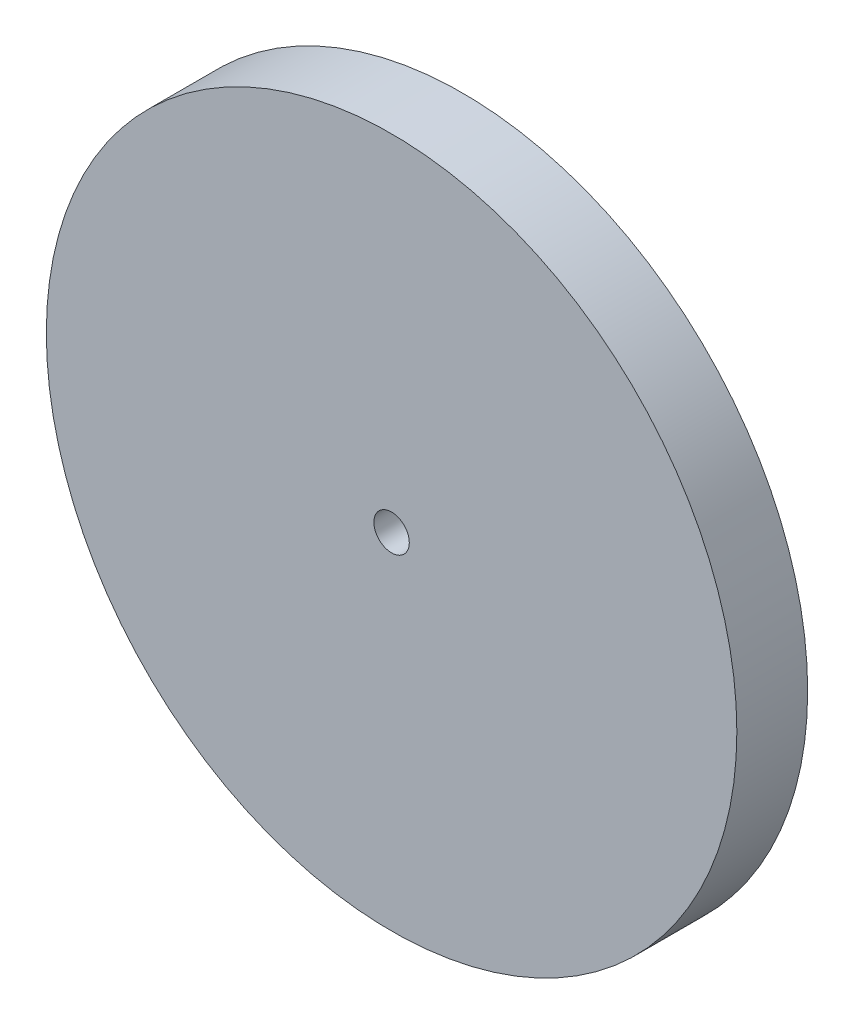
ISO-10303-21;
HEADER;
FILE_DESCRIPTION(('STEP AP214'),'2;1');
FILE_NAME('part.step','',(''),(''),'','','');
FILE_SCHEMA(('AUTOMOTIVE_DESIGN { 1 0 10303 214 1 1 1 1 }'));
ENDSEC;
DATA;
#1=APPLICATION_CONTEXT('core data for automotive mechanical design processes');
#2=APPLICATION_PROTOCOL_DEFINITION('international standard','automotive_design',2000,#1);
#3=PRODUCT_CONTEXT('',#1,'mechanical');
#4=PRODUCT('Part','Part','',(#3));
#5=PRODUCT_RELATED_PRODUCT_CATEGORY('part','',(#4));
#6=PRODUCT_DEFINITION_FORMATION('','',#4);
#7=PRODUCT_DEFINITION_CONTEXT('part definition',#1,'design');
#8=PRODUCT_DEFINITION('design','',#6,#7);
#9=PRODUCT_DEFINITION_SHAPE('','',#8);
#10=(LENGTH_UNIT() NAMED_UNIT(*) SI_UNIT(.MILLI.,.METRE.));
#11=(NAMED_UNIT(*) PLANE_ANGLE_UNIT() SI_UNIT($,.RADIAN.));
#12=(NAMED_UNIT(*) SI_UNIT($,.STERADIAN.) SOLID_ANGLE_UNIT());
#13=UNCERTAINTY_MEASURE_WITH_UNIT(LENGTH_MEASURE(1.E-05),#10,'distance_accuracy_value','');
#14=(GEOMETRIC_REPRESENTATION_CONTEXT(3) GLOBAL_UNCERTAINTY_ASSIGNED_CONTEXT((#13)) GLOBAL_UNIT_ASSIGNED_CONTEXT((#10,
#11,#12)) REPRESENTATION_CONTEXT('',''));
#15=CARTESIAN_POINT('',(0.,0.,0.));
#16=DIRECTION('',(0.,0.,1.));
#17=DIRECTION('',(1.,0.,0.));
#18=AXIS2_PLACEMENT_3D('',#15,#16,#17);
#19=CARTESIAN_POINT('',(0.,0.,4.));
#20=DIRECTION('',(0.,0.,-1.));
#21=DIRECTION('',(-1.,0.,0.));
#22=AXIS2_PLACEMENT_3D('',#19,#20,#21);
#23=CYLINDRICAL_SURFACE('',#22,19.5);
#24=CARTESIAN_POINT('',(0.,0.,4.));
#25=DIRECTION('',(0.,0.,1.));
#26=DIRECTION('',(1.,0.,0.));
#27=AXIS2_PLACEMENT_3D('',#24,#25,#26);
#28=CIRCLE('',#27,19.5);
#29=CARTESIAN_POINT('',(19.5,0.,4.));
#30=VERTEX_POINT('',#29);
#31=EDGE_CURVE('E10',#30,#30,#28,.T.);
#32=ORIENTED_EDGE('',*,*,#31,.F.);
#33=EDGE_LOOP('',(#32));
#34=FACE_BOUND('',#33,.T.);
#35=CARTESIAN_POINT('',(0.,0.,0.));
#36=DIRECTION('',(0.,0.,1.));
#37=DIRECTION('',(1.,0.,0.));
#38=AXIS2_PLACEMENT_3D('',#35,#36,#37);
#39=CIRCLE('',#38,19.5);
#40=CARTESIAN_POINT('',(19.5,0.,0.));
#41=VERTEX_POINT('',#40);
#42=EDGE_CURVE('E46',#41,#41,#39,.T.);
#43=ORIENTED_EDGE('',*,*,#42,.T.);
#44=EDGE_LOOP('',(#43));
#45=FACE_BOUND('',#44,.T.);
#46=ADVANCED_FACE('F43',(#34,#45),#23,.T.);
#47=CARTESIAN_POINT('',(0.,0.,4.));
#48=DIRECTION('',(0.,0.,1.));
#49=DIRECTION('',(1.,0.,0.));
#50=AXIS2_PLACEMENT_3D('',#47,#48,#49);
#51=PLANE('',#50);
#52=CARTESIAN_POINT('',(0.,0.,4.));
#53=DIRECTION('',(0.,0.,1.));
#54=DIRECTION('',(1.,0.,0.));
#55=AXIS2_PLACEMENT_3D('',#52,#53,#54);
#56=CIRCLE('',#55,1.);
#57=CARTESIAN_POINT('',(1.,0.,4.));
#58=VERTEX_POINT('',#57);
#59=EDGE_CURVE('E57',#58,#58,#56,.T.);
#60=ORIENTED_EDGE('',*,*,#59,.F.);
#61=EDGE_LOOP('',(#60));
#62=FACE_BOUND('',#61,.T.);
#63=ORIENTED_EDGE('',*,*,#31,.T.);
#64=EDGE_LOOP('',(#63));
#65=FACE_BOUND('',#64,.T.);
#66=ADVANCED_FACE('F74',(#62,#65),#51,.T.);
#67=CARTESIAN_POINT('',(0.,0.,0.));
#68=DIRECTION('',(0.,0.,1.));
#69=DIRECTION('',(1.,0.,0.));
#70=AXIS2_PLACEMENT_3D('',#67,#68,#69);
#71=PLANE('',#70);
#72=CARTESIAN_POINT('',(0.,0.,0.));
#73=DIRECTION('',(0.,0.,1.));
#74=DIRECTION('',(1.,0.,0.));
#75=AXIS2_PLACEMENT_3D('',#72,#73,#74);
#76=CIRCLE('',#75,1.);
#77=CARTESIAN_POINT('',(1.,0.,0.));
#78=VERTEX_POINT('',#77);
#79=EDGE_CURVE('E55',#78,#78,#76,.T.);
#80=ORIENTED_EDGE('',*,*,#79,.T.);
#81=EDGE_LOOP('',(#80));
#82=FACE_BOUND('',#81,.T.);
#83=ORIENTED_EDGE('',*,*,#42,.F.);
#84=EDGE_LOOP('',(#83));
#85=FACE_BOUND('',#84,.T.);
#86=ADVANCED_FACE('F65',(#82,#85),#71,.F.);
#87=CARTESIAN_POINT('',(0.,0.,0.));
#88=DIRECTION('',(0.,0.,1.));
#89=DIRECTION('',(1.,0.,0.));
#90=AXIS2_PLACEMENT_3D('',#87,#88,#89);
#91=CYLINDRICAL_SURFACE('',#90,1.);
#92=ORIENTED_EDGE('',*,*,#79,.F.);
#93=EDGE_LOOP('',(#92));
#94=FACE_BOUND('',#93,.T.);
#95=ORIENTED_EDGE('',*,*,#59,.T.);
#96=EDGE_LOOP('',(#95));
#97=FACE_BOUND('',#96,.T.);
#98=ADVANCED_FACE('F68',(#94,#97),#91,.F.);
#99=CLOSED_SHELL('',(#46,#66,#86,#98));
#100=MANIFOLD_SOLID_BREP('B2',#99);
#101=ADVANCED_BREP_SHAPE_REPRESENTATION('',(#18,#100),#14);
#102=SHAPE_DEFINITION_REPRESENTATION(#9,#101);
ENDSEC;
END-ISO-10303-21;
